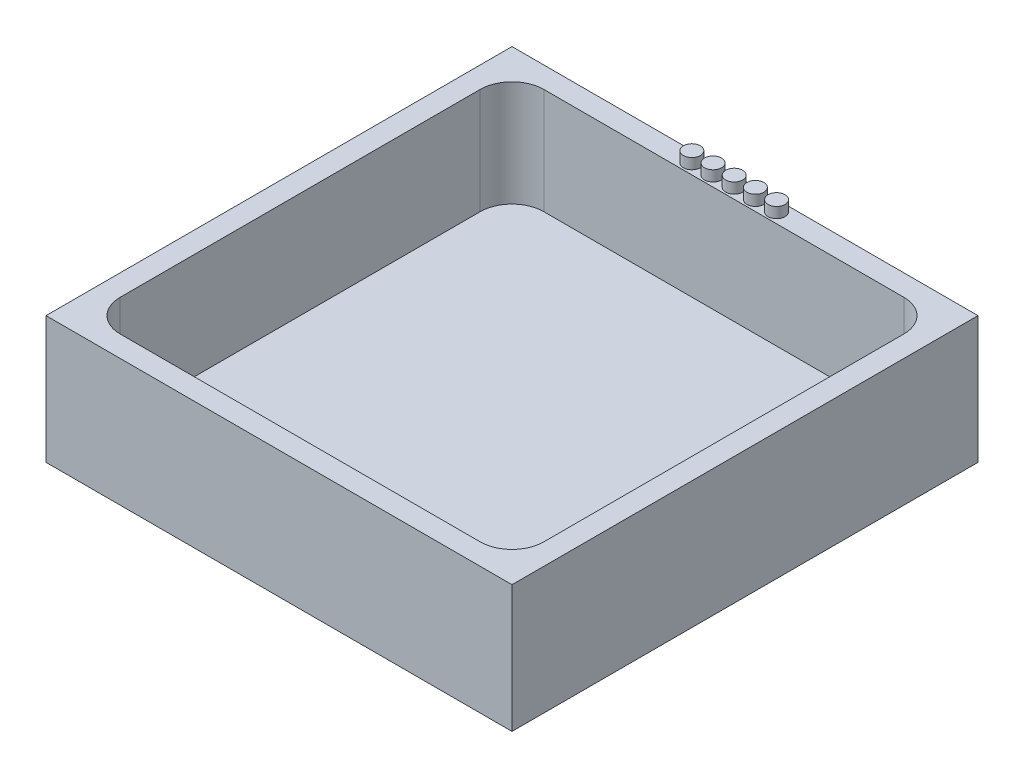
ISO-10303-21;
HEADER;
FILE_DESCRIPTION(('STEP AP214'),'2;1');
FILE_NAME('part.step','',(''),(''),'','','');
FILE_SCHEMA(('AUTOMOTIVE_DESIGN { 1 0 10303 214 1 1 1 1 }'));
ENDSEC;
DATA;
#1=APPLICATION_CONTEXT('core data for automotive mechanical design processes');
#2=APPLICATION_PROTOCOL_DEFINITION('international standard','automotive_design',2000,#1);
#3=PRODUCT_CONTEXT('',#1,'mechanical');
#4=PRODUCT('Part','Part','',(#3));
#5=PRODUCT_RELATED_PRODUCT_CATEGORY('part','',(#4));
#6=PRODUCT_DEFINITION_FORMATION('','',#4);
#7=PRODUCT_DEFINITION_CONTEXT('part definition',#1,'design');
#8=PRODUCT_DEFINITION('design','',#6,#7);
#9=PRODUCT_DEFINITION_SHAPE('','',#8);
#10=(LENGTH_UNIT() NAMED_UNIT(*) SI_UNIT(.MILLI.,.METRE.));
#11=(NAMED_UNIT(*) PLANE_ANGLE_UNIT() SI_UNIT($,.RADIAN.));
#12=(NAMED_UNIT(*) SI_UNIT($,.STERADIAN.) SOLID_ANGLE_UNIT());
#13=UNCERTAINTY_MEASURE_WITH_UNIT(LENGTH_MEASURE(1.E-05),#10,'distance_accuracy_value','');
#14=(GEOMETRIC_REPRESENTATION_CONTEXT(3) GLOBAL_UNCERTAINTY_ASSIGNED_CONTEXT((#13)) GLOBAL_UNIT_ASSIGNED_CONTEXT((#10,
#11,#12)) REPRESENTATION_CONTEXT('',''));
#15=CARTESIAN_POINT('',(0.,0.,0.));
#16=DIRECTION('',(0.,0.,1.));
#17=DIRECTION('',(1.,0.,0.));
#18=AXIS2_PLACEMENT_3D('',#15,#16,#17);
#19=CARTESIAN_POINT('',(0.,1.,0.));
#20=DIRECTION('',(0.,-1.,0.));
#21=DIRECTION('',(0.,0.,-1.));
#22=AXIS2_PLACEMENT_3D('',#19,#20,#21);
#23=PLANE('',#22);
#24=DIRECTION('',(1.,0.,0.));
#25=VECTOR('',#24,1.);
#26=CARTESIAN_POINT('',(-10.,1.,10.));
#27=LINE('',#26,#25);
#28=CARTESIAN_POINT('',(-8.5,1.,10.));
#29=VERTEX_POINT('',#28);
#30=CARTESIAN_POINT('',(8.5,1.,10.));
#31=VERTEX_POINT('',#30);
#32=EDGE_CURVE('E166',#29,#31,#27,.T.);
#33=ORIENTED_EDGE('',*,*,#32,.T.);
#34=CARTESIAN_POINT('',(8.5,1.,8.5));
#35=DIRECTION('',(0.,-1.,0.));
#36=DIRECTION('',(0.,0.,-1.));
#37=AXIS2_PLACEMENT_3D('',#34,#35,#36);
#38=CIRCLE('',#37,1.5);
#39=CARTESIAN_POINT('',(10.,1.,8.5));
#40=VERTEX_POINT('',#39);
#41=EDGE_CURVE('E195',#31,#40,#38,.F.);
#42=ORIENTED_EDGE('',*,*,#41,.T.);
#43=DIRECTION('',(0.,0.,-1.));
#44=VECTOR('',#43,1.);
#45=CARTESIAN_POINT('',(10.,1.,10.));
#46=LINE('',#45,#44);
#47=CARTESIAN_POINT('',(10.,1.,-8.5));
#48=VERTEX_POINT('',#47);
#49=EDGE_CURVE('E163',#40,#48,#46,.T.);
#50=ORIENTED_EDGE('',*,*,#49,.T.);
#51=CARTESIAN_POINT('',(8.5,1.,-8.5));
#52=DIRECTION('',(0.,-1.,0.));
#53=DIRECTION('',(0.,0.,-1.));
#54=AXIS2_PLACEMENT_3D('',#51,#52,#53);
#55=CIRCLE('',#54,1.5);
#56=CARTESIAN_POINT('',(8.5,1.,-10.));
#57=VERTEX_POINT('',#56);
#58=EDGE_CURVE('E189',#48,#57,#55,.F.);
#59=ORIENTED_EDGE('',*,*,#58,.T.);
#60=DIRECTION('',(1.,0.,0.));
#61=VECTOR('',#60,1.);
#62=CARTESIAN_POINT('',(-10.,1.,-10.));
#63=LINE('',#62,#61);
#64=CARTESIAN_POINT('',(-8.5,1.,-10.));
#65=VERTEX_POINT('',#64);
#66=EDGE_CURVE('E155',#65,#57,#63,.T.);
#67=ORIENTED_EDGE('',*,*,#66,.F.);
#68=CARTESIAN_POINT('',(-8.5,1.,-8.5));
#69=DIRECTION('',(0.,-1.,0.));
#70=DIRECTION('',(0.,0.,-1.));
#71=AXIS2_PLACEMENT_3D('',#68,#69,#70);
#72=CIRCLE('',#71,1.5);
#73=CARTESIAN_POINT('',(-10.,1.,-8.5));
#74=VERTEX_POINT('',#73);
#75=EDGE_CURVE('E193',#65,#74,#72,.F.);
#76=ORIENTED_EDGE('',*,*,#75,.T.);
#77=DIRECTION('',(0.,0.,-1.));
#78=VECTOR('',#77,1.);
#79=CARTESIAN_POINT('',(-10.,1.,10.));
#80=LINE('',#79,#78);
#81=CARTESIAN_POINT('',(-10.,1.,8.5));
#82=VERTEX_POINT('',#81);
#83=EDGE_CURVE('E153',#82,#74,#80,.T.);
#84=ORIENTED_EDGE('',*,*,#83,.F.);
#85=CARTESIAN_POINT('',(-8.5,1.,8.5));
#86=DIRECTION('',(0.,-1.,0.));
#87=DIRECTION('',(0.,0.,-1.));
#88=AXIS2_PLACEMENT_3D('',#85,#86,#87);
#89=CIRCLE('',#88,1.5);
#90=EDGE_CURVE('E191',#82,#29,#89,.F.);
#91=ORIENTED_EDGE('',*,*,#90,.T.);
#92=EDGE_LOOP('',(#33,#42,#50,#59,#67,#76,#84,#91));
#93=FACE_BOUND('',#92,.T.);
#94=ADVANCED_FACE('F39',(#93),#23,.F.);
#95=CARTESIAN_POINT('',(10.,6.,10.));
#96=DIRECTION('',(-1.,0.,0.));
#97=DIRECTION('',(0.,0.,1.));
#98=AXIS2_PLACEMENT_3D('',#95,#96,#97);
#99=PLANE('',#98);
#100=ORIENTED_EDGE('',*,*,#49,.F.);
#101=DIRECTION('',(0.,-1.,0.));
#102=VECTOR('',#101,1.);
#103=CARTESIAN_POINT('',(10.,6.,8.5));
#104=LINE('',#103,#102);
#105=CARTESIAN_POINT('',(10.,6.,8.5));
#106=VERTEX_POINT('',#105);
#107=EDGE_CURVE('E200',#40,#106,#104,.F.);
#108=ORIENTED_EDGE('',*,*,#107,.T.);
#109=DIRECTION('',(0.,0.,-1.));
#110=VECTOR('',#109,1.);
#111=CARTESIAN_POINT('',(10.,6.,10.));
#112=LINE('',#111,#110);
#113=CARTESIAN_POINT('',(10.,6.,-8.5));
#114=VERTEX_POINT('',#113);
#115=EDGE_CURVE('E227',#106,#114,#112,.T.);
#116=ORIENTED_EDGE('',*,*,#115,.T.);
#117=DIRECTION('',(0.,-1.,0.));
#118=VECTOR('',#117,1.);
#119=CARTESIAN_POINT('',(10.,1.,-8.5));
#120=LINE('',#119,#118);
#121=EDGE_CURVE('E197',#114,#48,#120,.T.);
#122=ORIENTED_EDGE('',*,*,#121,.T.);
#123=EDGE_LOOP('',(#100,#108,#116,#122));
#124=FACE_BOUND('',#123,.T.);
#125=ADVANCED_FACE('F249',(#124),#99,.T.);
#126=CARTESIAN_POINT('',(-10.,6.,-10.));
#127=DIRECTION('',(0.,0.,1.));
#128=DIRECTION('',(1.,0.,0.));
#129=AXIS2_PLACEMENT_3D('',#126,#127,#128);
#130=PLANE('',#129);
#131=DIRECTION('',(-1.,0.,0.));
#132=VECTOR('',#131,1.);
#133=CARTESIAN_POINT('',(-10.,6.,-10.));
#134=LINE('',#133,#132);
#135=CARTESIAN_POINT('',(8.5,6.,-10.));
#136=VERTEX_POINT('',#135);
#137=CARTESIAN_POINT('',(-8.5,6.,-10.));
#138=VERTEX_POINT('',#137);
#139=EDGE_CURVE('E218',#136,#138,#134,.T.);
#140=ORIENTED_EDGE('',*,*,#139,.T.);
#141=DIRECTION('',(0.,-1.,0.));
#142=VECTOR('',#141,1.);
#143=CARTESIAN_POINT('',(-8.5,1.,-10.));
#144=LINE('',#143,#142);
#145=EDGE_CURVE('E204',#138,#65,#144,.T.);
#146=ORIENTED_EDGE('',*,*,#145,.T.);
#147=ORIENTED_EDGE('',*,*,#66,.T.);
#148=DIRECTION('',(0.,-1.,0.));
#149=VECTOR('',#148,1.);
#150=CARTESIAN_POINT('',(8.5,6.,-10.));
#151=LINE('',#150,#149);
#152=EDGE_CURVE('E202',#57,#136,#151,.F.);
#153=ORIENTED_EDGE('',*,*,#152,.T.);
#154=EDGE_LOOP('',(#140,#146,#147,#153));
#155=FACE_BOUND('',#154,.T.);
#156=ADVANCED_FACE('F224',(#155),#130,.T.);
#157=CARTESIAN_POINT('',(-10.,6.,10.));
#158=DIRECTION('',(1.,0.,0.));
#159=DIRECTION('',(0.,0.,-1.));
#160=AXIS2_PLACEMENT_3D('',#157,#158,#159);
#161=PLANE('',#160);
#162=ORIENTED_EDGE('',*,*,#83,.T.);
#163=DIRECTION('',(0.,-1.,0.));
#164=VECTOR('',#163,1.);
#165=CARTESIAN_POINT('',(-10.,6.,-8.5));
#166=LINE('',#165,#164);
#167=CARTESIAN_POINT('',(-10.,6.,-8.5));
#168=VERTEX_POINT('',#167);
#169=EDGE_CURVE('E60',#74,#168,#166,.F.);
#170=ORIENTED_EDGE('',*,*,#169,.T.);
#171=DIRECTION('',(0.,0.,1.));
#172=VECTOR('',#171,1.);
#173=CARTESIAN_POINT('',(-10.,6.,10.));
#174=LINE('',#173,#172);
#175=CARTESIAN_POINT('',(-10.,6.,8.5));
#176=VERTEX_POINT('',#175);
#177=EDGE_CURVE('E220',#168,#176,#174,.T.);
#178=ORIENTED_EDGE('',*,*,#177,.T.);
#179=DIRECTION('',(0.,-1.,0.));
#180=VECTOR('',#179,1.);
#181=CARTESIAN_POINT('',(-10.,1.,8.5));
#182=LINE('',#181,#180);
#183=EDGE_CURVE('E207',#176,#82,#182,.T.);
#184=ORIENTED_EDGE('',*,*,#183,.T.);
#185=EDGE_LOOP('',(#162,#170,#178,#184));
#186=FACE_BOUND('',#185,.T.);
#187=ADVANCED_FACE('F232',(#186),#161,.T.);
#188=CARTESIAN_POINT('',(-10.,6.,10.));
#189=DIRECTION('',(0.,0.,-1.));
#190=DIRECTION('',(-1.,0.,0.));
#191=AXIS2_PLACEMENT_3D('',#188,#189,#190);
#192=PLANE('',#191);
#193=DIRECTION('',(1.,0.,0.));
#194=VECTOR('',#193,1.);
#195=CARTESIAN_POINT('',(-10.,6.,10.));
#196=LINE('',#195,#194);
#197=CARTESIAN_POINT('',(-8.5,6.,10.));
#198=VERTEX_POINT('',#197);
#199=CARTESIAN_POINT('',(8.5,6.,10.));
#200=VERTEX_POINT('',#199);
#201=EDGE_CURVE('E242',#198,#200,#196,.T.);
#202=ORIENTED_EDGE('',*,*,#201,.T.);
#203=DIRECTION('',(0.,-1.,0.));
#204=VECTOR('',#203,1.);
#205=CARTESIAN_POINT('',(8.5,1.,10.));
#206=LINE('',#205,#204);
#207=EDGE_CURVE('E186',#200,#31,#206,.T.);
#208=ORIENTED_EDGE('',*,*,#207,.T.);
#209=ORIENTED_EDGE('',*,*,#32,.F.);
#210=DIRECTION('',(0.,-1.,0.));
#211=VECTOR('',#210,1.);
#212=CARTESIAN_POINT('',(-8.5,6.,10.));
#213=LINE('',#212,#211);
#214=EDGE_CURVE('E184',#29,#198,#213,.F.);
#215=ORIENTED_EDGE('',*,*,#214,.T.);
#216=EDGE_LOOP('',(#202,#208,#209,#215));
#217=FACE_BOUND('',#216,.T.);
#218=ADVANCED_FACE('F240',(#217),#192,.T.);
#219=CARTESIAN_POINT('',(0.,6.,0.));
#220=DIRECTION('',(0.,-1.,0.));
#221=DIRECTION('',(0.,0.,-1.));
#222=AXIS2_PLACEMENT_3D('',#219,#220,#221);
#223=PLANE('',#222);
#224=CARTESIAN_POINT('',(2.,6.,-10.4901556882709));
#225=DIRECTION('',(0.,-1.,0.));
#226=DIRECTION('',(0.,0.,-1.));
#227=AXIS2_PLACEMENT_3D('',#224,#225,#226);
#228=CIRCLE('',#227,0.4);
#229=CARTESIAN_POINT('',(2.,6.,-10.8901556882709));
#230=VERTEX_POINT('',#229);
#231=EDGE_CURVE('E181',#230,#230,#228,.F.);
#232=ORIENTED_EDGE('',*,*,#231,.F.);
#233=EDGE_LOOP('',(#232));
#234=FACE_BOUND('',#233,.T.);
#235=CARTESIAN_POINT('',(-2.,6.,-10.4901556882709));
#236=DIRECTION('',(0.,-1.,0.));
#237=DIRECTION('',(0.,0.,-1.));
#238=AXIS2_PLACEMENT_3D('',#235,#236,#237);
#239=CIRCLE('',#238,0.4);
#240=CARTESIAN_POINT('',(-2.,6.,-10.8901556882709));
#241=VERTEX_POINT('',#240);
#242=EDGE_CURVE('E178',#241,#241,#239,.F.);
#243=ORIENTED_EDGE('',*,*,#242,.F.);
#244=EDGE_LOOP('',(#243));
#245=FACE_BOUND('',#244,.T.);
#246=CARTESIAN_POINT('',(-1.,6.,-10.4901556882709));
#247=DIRECTION('',(0.,-1.,0.));
#248=DIRECTION('',(0.,0.,-1.));
#249=AXIS2_PLACEMENT_3D('',#246,#247,#248);
#250=CIRCLE('',#249,0.4);
#251=CARTESIAN_POINT('',(-1.,6.,-10.8901556882709));
#252=VERTEX_POINT('',#251);
#253=EDGE_CURVE('E175',#252,#252,#250,.F.);
#254=ORIENTED_EDGE('',*,*,#253,.F.);
#255=EDGE_LOOP('',(#254));
#256=FACE_BOUND('',#255,.T.);
#257=CARTESIAN_POINT('',(1.,6.,-10.4901556882709));
#258=DIRECTION('',(0.,-1.,0.));
#259=DIRECTION('',(0.,0.,-1.));
#260=AXIS2_PLACEMENT_3D('',#257,#258,#259);
#261=CIRCLE('',#260,0.4);
#262=CARTESIAN_POINT('',(1.,6.,-10.8901556882709));
#263=VERTEX_POINT('',#262);
#264=EDGE_CURVE('E172',#263,#263,#261,.F.);
#265=ORIENTED_EDGE('',*,*,#264,.F.);
#266=EDGE_LOOP('',(#265));
#267=FACE_BOUND('',#266,.T.);
#268=CARTESIAN_POINT('',(0.,6.,-10.4901556882709));
#269=DIRECTION('',(0.,-1.,0.));
#270=DIRECTION('',(0.,0.,-1.));
#271=AXIS2_PLACEMENT_3D('',#268,#269,#270);
#272=CIRCLE('',#271,0.4);
#273=CARTESIAN_POINT('',(0.,6.,-10.8901556882709));
#274=VERTEX_POINT('',#273);
#275=EDGE_CURVE('E169',#274,#274,#272,.F.);
#276=ORIENTED_EDGE('',*,*,#275,.F.);
#277=EDGE_LOOP('',(#276));
#278=FACE_BOUND('',#277,.T.);
#279=DIRECTION('',(0.,0.,-1.));
#280=VECTOR('',#279,1.);
#281=CARTESIAN_POINT('',(11.,6.,11.));
#282=LINE('',#281,#280);
#283=CARTESIAN_POINT('',(11.,6.,11.));
#284=VERTEX_POINT('',#283);
#285=CARTESIAN_POINT('',(11.,6.,-11.));
#286=VERTEX_POINT('',#285);
#287=EDGE_CURVE('E139',#284,#286,#282,.T.);
#288=ORIENTED_EDGE('',*,*,#287,.T.);
#289=DIRECTION('',(-1.,0.,0.));
#290=VECTOR('',#289,1.);
#291=CARTESIAN_POINT('',(-11.,6.,-11.));
#292=LINE('',#291,#290);
#293=CARTESIAN_POINT('',(-11.,6.,-11.));
#294=VERTEX_POINT('',#293);
#295=EDGE_CURVE('E128',#286,#294,#292,.T.);
#296=ORIENTED_EDGE('',*,*,#295,.T.);
#297=DIRECTION('',(0.,0.,1.));
#298=VECTOR('',#297,1.);
#299=CARTESIAN_POINT('',(-11.,6.,11.));
#300=LINE('',#299,#298);
#301=CARTESIAN_POINT('',(-11.,6.,11.));
#302=VERTEX_POINT('',#301);
#303=EDGE_CURVE('E138',#294,#302,#300,.T.);
#304=ORIENTED_EDGE('',*,*,#303,.T.);
#305=DIRECTION('',(1.,0.,0.));
#306=VECTOR('',#305,1.);
#307=CARTESIAN_POINT('',(-11.,6.,11.));
#308=LINE('',#307,#306);
#309=EDGE_CURVE('E144',#302,#284,#308,.T.);
#310=ORIENTED_EDGE('',*,*,#309,.T.);
#311=EDGE_LOOP('',(#288,#296,#304,#310));
#312=FACE_BOUND('',#311,.T.);
#313=ORIENTED_EDGE('',*,*,#115,.F.);
#314=CARTESIAN_POINT('',(8.5,6.,8.5));
#315=DIRECTION('',(0.,-1.,0.));
#316=DIRECTION('',(0.,0.,-1.));
#317=AXIS2_PLACEMENT_3D('',#314,#315,#316);
#318=CIRCLE('',#317,1.5);
#319=EDGE_CURVE('E211',#106,#200,#318,.T.);
#320=ORIENTED_EDGE('',*,*,#319,.T.);
#321=ORIENTED_EDGE('',*,*,#201,.F.);
#322=CARTESIAN_POINT('',(-8.5,6.,8.5));
#323=DIRECTION('',(0.,-1.,0.));
#324=DIRECTION('',(0.,0.,-1.));
#325=AXIS2_PLACEMENT_3D('',#322,#323,#324);
#326=CIRCLE('',#325,1.5);
#327=EDGE_CURVE('E47',#198,#176,#326,.T.);
#328=ORIENTED_EDGE('',*,*,#327,.T.);
#329=ORIENTED_EDGE('',*,*,#177,.F.);
#330=CARTESIAN_POINT('',(-8.5,6.,-8.5));
#331=DIRECTION('',(0.,-1.,0.));
#332=DIRECTION('',(0.,0.,-1.));
#333=AXIS2_PLACEMENT_3D('',#330,#331,#332);
#334=CIRCLE('',#333,1.5);
#335=EDGE_CURVE('E213',#168,#138,#334,.T.);
#336=ORIENTED_EDGE('',*,*,#335,.T.);
#337=ORIENTED_EDGE('',*,*,#139,.F.);
#338=CARTESIAN_POINT('',(8.5,6.,-8.5));
#339=DIRECTION('',(0.,-1.,0.));
#340=DIRECTION('',(0.,0.,-1.));
#341=AXIS2_PLACEMENT_3D('',#338,#339,#340);
#342=CIRCLE('',#341,1.5);
#343=EDGE_CURVE('E11',#136,#114,#342,.T.);
#344=ORIENTED_EDGE('',*,*,#343,.T.);
#345=EDGE_LOOP('',(#313,#320,#321,#328,#329,#336,#337,#344));
#346=FACE_BOUND('',#345,.T.);
#347=ADVANCED_FACE('F142',(#234,#245,#256,#267,#278,#312,#346),#223,.F.);
#348=CARTESIAN_POINT('',(11.,6.,11.));
#349=DIRECTION('',(-1.,0.,0.));
#350=DIRECTION('',(0.,0.,1.));
#351=AXIS2_PLACEMENT_3D('',#348,#349,#350);
#352=PLANE('',#351);
#353=DIRECTION('',(0.,0.,-1.));
#354=VECTOR('',#353,1.);
#355=CARTESIAN_POINT('',(11.,0.,11.));
#356=LINE('',#355,#354);
#357=CARTESIAN_POINT('',(11.,0.,11.));
#358=VERTEX_POINT('',#357);
#359=CARTESIAN_POINT('',(11.,0.,-11.));
#360=VERTEX_POINT('',#359);
#361=EDGE_CURVE('E152',#358,#360,#356,.T.);
#362=ORIENTED_EDGE('',*,*,#361,.T.);
#363=DIRECTION('',(0.,-1.,0.));
#364=VECTOR('',#363,1.);
#365=CARTESIAN_POINT('',(11.,6.,-11.));
#366=LINE('',#365,#364);
#367=EDGE_CURVE('E132',#286,#360,#366,.T.);
#368=ORIENTED_EDGE('',*,*,#367,.F.);
#369=ORIENTED_EDGE('',*,*,#287,.F.);
#370=DIRECTION('',(0.,-1.,0.));
#371=VECTOR('',#370,1.);
#372=CARTESIAN_POINT('',(11.,6.,11.));
#373=LINE('',#372,#371);
#374=EDGE_CURVE('E264',#284,#358,#373,.T.);
#375=ORIENTED_EDGE('',*,*,#374,.T.);
#376=EDGE_LOOP('',(#362,#368,#369,#375));
#377=FACE_BOUND('',#376,.T.);
#378=ADVANCED_FACE('F150',(#377),#352,.F.);
#379=CARTESIAN_POINT('',(-11.,6.,-11.));
#380=DIRECTION('',(0.,0.,1.));
#381=DIRECTION('',(1.,0.,0.));
#382=AXIS2_PLACEMENT_3D('',#379,#380,#381);
#383=PLANE('',#382);
#384=DIRECTION('',(-1.,0.,0.));
#385=VECTOR('',#384,1.);
#386=CARTESIAN_POINT('',(-11.,0.,-11.));
#387=LINE('',#386,#385);
#388=CARTESIAN_POINT('',(-11.,0.,-11.));
#389=VERTEX_POINT('',#388);
#390=EDGE_CURVE('E266',#360,#389,#387,.T.);
#391=ORIENTED_EDGE('',*,*,#390,.T.);
#392=DIRECTION('',(0.,-1.,0.));
#393=VECTOR('',#392,1.);
#394=CARTESIAN_POINT('',(-11.,6.,-11.));
#395=LINE('',#394,#393);
#396=EDGE_CURVE('E135',#294,#389,#395,.T.);
#397=ORIENTED_EDGE('',*,*,#396,.F.);
#398=ORIENTED_EDGE('',*,*,#295,.F.);
#399=ORIENTED_EDGE('',*,*,#367,.T.);
#400=EDGE_LOOP('',(#391,#397,#398,#399));
#401=FACE_BOUND('',#400,.T.);
#402=ADVANCED_FACE('F130',(#401),#383,.F.);
#403=CARTESIAN_POINT('',(-11.,6.,11.));
#404=DIRECTION('',(1.,0.,0.));
#405=DIRECTION('',(0.,0.,-1.));
#406=AXIS2_PLACEMENT_3D('',#403,#404,#405);
#407=PLANE('',#406);
#408=DIRECTION('',(0.,0.,1.));
#409=VECTOR('',#408,1.);
#410=CARTESIAN_POINT('',(-11.,0.,11.));
#411=LINE('',#410,#409);
#412=CARTESIAN_POINT('',(-11.,0.,11.));
#413=VERTEX_POINT('',#412);
#414=EDGE_CURVE('E268',#389,#413,#411,.T.);
#415=ORIENTED_EDGE('',*,*,#414,.T.);
#416=DIRECTION('',(0.,-1.,0.));
#417=VECTOR('',#416,1.);
#418=CARTESIAN_POINT('',(-11.,6.,11.));
#419=LINE('',#418,#417);
#420=EDGE_CURVE('E157',#302,#413,#419,.T.);
#421=ORIENTED_EDGE('',*,*,#420,.F.);
#422=ORIENTED_EDGE('',*,*,#303,.F.);
#423=ORIENTED_EDGE('',*,*,#396,.T.);
#424=EDGE_LOOP('',(#415,#421,#422,#423));
#425=FACE_BOUND('',#424,.T.);
#426=ADVANCED_FACE('F280',(#425),#407,.F.);
#427=CARTESIAN_POINT('',(-11.,6.,11.));
#428=DIRECTION('',(0.,0.,-1.));
#429=DIRECTION('',(-1.,0.,0.));
#430=AXIS2_PLACEMENT_3D('',#427,#428,#429);
#431=PLANE('',#430);
#432=DIRECTION('',(1.,0.,0.));
#433=VECTOR('',#432,1.);
#434=CARTESIAN_POINT('',(-11.,0.,11.));
#435=LINE('',#434,#433);
#436=EDGE_CURVE('E148',#413,#358,#435,.T.);
#437=ORIENTED_EDGE('',*,*,#436,.T.);
#438=ORIENTED_EDGE('',*,*,#374,.F.);
#439=ORIENTED_EDGE('',*,*,#309,.F.);
#440=ORIENTED_EDGE('',*,*,#420,.T.);
#441=EDGE_LOOP('',(#437,#438,#439,#440));
#442=FACE_BOUND('',#441,.T.);
#443=ADVANCED_FACE('F275',(#442),#431,.F.);
#444=CARTESIAN_POINT('',(0.,0.,0.));
#445=DIRECTION('',(0.,-1.,0.));
#446=DIRECTION('',(0.,0.,-1.));
#447=AXIS2_PLACEMENT_3D('',#444,#445,#446);
#448=PLANE('',#447);
#449=ORIENTED_EDGE('',*,*,#361,.F.);
#450=ORIENTED_EDGE('',*,*,#436,.F.);
#451=ORIENTED_EDGE('',*,*,#414,.F.);
#452=ORIENTED_EDGE('',*,*,#390,.F.);
#453=EDGE_LOOP('',(#449,#450,#451,#452));
#454=FACE_BOUND('',#453,.T.);
#455=ADVANCED_FACE('F279',(#454),#448,.T.);
#456=CARTESIAN_POINT('',(0.,6.5,-10.4901556882709));
#457=DIRECTION('',(0.,-1.,0.));
#458=DIRECTION('',(0.,0.,-1.));
#459=AXIS2_PLACEMENT_3D('',#456,#457,#458);
#460=CYLINDRICAL_SURFACE('',#459,0.4);
#461=CARTESIAN_POINT('',(0.,6.5,-10.4901556882709));
#462=DIRECTION('',(0.,1.,0.));
#463=DIRECTION('',(0.,0.,1.));
#464=AXIS2_PLACEMENT_3D('',#461,#462,#463);
#465=CIRCLE('',#464,0.4);
#466=CARTESIAN_POINT('',(0.,6.5,-10.0901556882709));
#467=VERTEX_POINT('',#466);
#468=EDGE_CURVE('E253',#467,#467,#465,.T.);
#469=ORIENTED_EDGE('',*,*,#468,.F.);
#470=EDGE_LOOP('',(#469));
#471=FACE_BOUND('',#470,.T.);
#472=ORIENTED_EDGE('',*,*,#275,.T.);
#473=EDGE_LOOP('',(#472));
#474=FACE_BOUND('',#473,.T.);
#475=ADVANCED_FACE('F300',(#471,#474),#460,.T.);
#476=CARTESIAN_POINT('',(0.,6.5,-10.4901556882709));
#477=DIRECTION('',(0.,1.,0.));
#478=DIRECTION('',(0.,0.,1.));
#479=AXIS2_PLACEMENT_3D('',#476,#477,#478);
#480=PLANE('',#479);
#481=ORIENTED_EDGE('',*,*,#468,.T.);
#482=EDGE_LOOP('',(#481));
#483=FACE_BOUND('',#482,.T.);
#484=ADVANCED_FACE('F407',(#483),#480,.T.);
#485=CARTESIAN_POINT('',(1.,6.5,-10.4901556882709));
#486=DIRECTION('',(0.,-1.,0.));
#487=DIRECTION('',(0.,0.,-1.));
#488=AXIS2_PLACEMENT_3D('',#485,#486,#487);
#489=CYLINDRICAL_SURFACE('',#488,0.4);
#490=CARTESIAN_POINT('',(1.,6.5,-10.4901556882709));
#491=DIRECTION('',(0.,1.,0.));
#492=DIRECTION('',(0.,0.,1.));
#493=AXIS2_PLACEMENT_3D('',#490,#491,#492);
#494=CIRCLE('',#493,0.4);
#495=CARTESIAN_POINT('',(1.,6.5,-10.0901556882709));
#496=VERTEX_POINT('',#495);
#497=EDGE_CURVE('E256',#496,#496,#494,.T.);
#498=ORIENTED_EDGE('',*,*,#497,.F.);
#499=EDGE_LOOP('',(#498));
#500=FACE_BOUND('',#499,.T.);
#501=ORIENTED_EDGE('',*,*,#264,.T.);
#502=EDGE_LOOP('',(#501));
#503=FACE_BOUND('',#502,.T.);
#504=ADVANCED_FACE('F397',(#500,#503),#489,.T.);
#505=CARTESIAN_POINT('',(1.,6.5,-10.4901556882709));
#506=DIRECTION('',(0.,1.,0.));
#507=DIRECTION('',(0.,0.,1.));
#508=AXIS2_PLACEMENT_3D('',#505,#506,#507);
#509=PLANE('',#508);
#510=ORIENTED_EDGE('',*,*,#497,.T.);
#511=EDGE_LOOP('',(#510));
#512=FACE_BOUND('',#511,.T.);
#513=ADVANCED_FACE('F387',(#512),#509,.T.);
#514=CARTESIAN_POINT('',(-1.,6.5,-10.4901556882709));
#515=DIRECTION('',(0.,-1.,0.));
#516=DIRECTION('',(0.,0.,-1.));
#517=AXIS2_PLACEMENT_3D('',#514,#515,#516);
#518=CYLINDRICAL_SURFACE('',#517,0.4);
#519=CARTESIAN_POINT('',(-1.,6.5,-10.4901556882709));
#520=DIRECTION('',(0.,1.,0.));
#521=DIRECTION('',(0.,0.,1.));
#522=AXIS2_PLACEMENT_3D('',#519,#520,#521);
#523=CIRCLE('',#522,0.4);
#524=CARTESIAN_POINT('',(-1.,6.5,-10.0901556882709));
#525=VERTEX_POINT('',#524);
#526=EDGE_CURVE('E520',#525,#525,#523,.T.);
#527=ORIENTED_EDGE('',*,*,#526,.F.);
#528=EDGE_LOOP('',(#527));
#529=FACE_BOUND('',#528,.T.);
#530=ORIENTED_EDGE('',*,*,#253,.T.);
#531=EDGE_LOOP('',(#530));
#532=FACE_BOUND('',#531,.T.);
#533=ADVANCED_FACE('F377',(#529,#532),#518,.T.);
#534=CARTESIAN_POINT('',(-1.,6.5,-10.4901556882709));
#535=DIRECTION('',(0.,1.,0.));
#536=DIRECTION('',(0.,0.,1.));
#537=AXIS2_PLACEMENT_3D('',#534,#535,#536);
#538=PLANE('',#537);
#539=ORIENTED_EDGE('',*,*,#526,.T.);
#540=EDGE_LOOP('',(#539));
#541=FACE_BOUND('',#540,.T.);
#542=ADVANCED_FACE('F367',(#541),#538,.T.);
#543=CARTESIAN_POINT('',(-2.,6.5,-10.4901556882709));
#544=DIRECTION('',(0.,-1.,0.));
#545=DIRECTION('',(0.,0.,-1.));
#546=AXIS2_PLACEMENT_3D('',#543,#544,#545);
#547=CYLINDRICAL_SURFACE('',#546,0.4);
#548=CARTESIAN_POINT('',(-2.,6.5,-10.4901556882709));
#549=DIRECTION('',(0.,1.,0.));
#550=DIRECTION('',(0.,0.,1.));
#551=AXIS2_PLACEMENT_3D('',#548,#549,#550);
#552=CIRCLE('',#551,0.4);
#553=CARTESIAN_POINT('',(-2.,6.5,-10.0901556882709));
#554=VERTEX_POINT('',#553);
#555=EDGE_CURVE('E522',#554,#554,#552,.T.);
#556=ORIENTED_EDGE('',*,*,#555,.F.);
#557=EDGE_LOOP('',(#556));
#558=FACE_BOUND('',#557,.T.);
#559=ORIENTED_EDGE('',*,*,#242,.T.);
#560=EDGE_LOOP('',(#559));
#561=FACE_BOUND('',#560,.T.);
#562=ADVANCED_FACE('F357',(#558,#561),#547,.T.);
#563=CARTESIAN_POINT('',(-2.,6.5,-10.4901556882709));
#564=DIRECTION('',(0.,1.,0.));
#565=DIRECTION('',(0.,0.,1.));
#566=AXIS2_PLACEMENT_3D('',#563,#564,#565);
#567=PLANE('',#566);
#568=ORIENTED_EDGE('',*,*,#555,.T.);
#569=EDGE_LOOP('',(#568));
#570=FACE_BOUND('',#569,.T.);
#571=ADVANCED_FACE('F347',(#570),#567,.T.);
#572=CARTESIAN_POINT('',(2.,6.5,-10.4901556882709));
#573=DIRECTION('',(0.,-1.,0.));
#574=DIRECTION('',(0.,0.,-1.));
#575=AXIS2_PLACEMENT_3D('',#572,#573,#574);
#576=CYLINDRICAL_SURFACE('',#575,0.4);
#577=CARTESIAN_POINT('',(2.,6.5,-10.4901556882709));
#578=DIRECTION('',(0.,1.,0.));
#579=DIRECTION('',(0.,0.,1.));
#580=AXIS2_PLACEMENT_3D('',#577,#578,#579);
#581=CIRCLE('',#580,0.4);
#582=CARTESIAN_POINT('',(2.,6.5,-10.0901556882709));
#583=VERTEX_POINT('',#582);
#584=EDGE_CURVE('E527',#583,#583,#581,.T.);
#585=ORIENTED_EDGE('',*,*,#584,.F.);
#586=EDGE_LOOP('',(#585));
#587=FACE_BOUND('',#586,.T.);
#588=ORIENTED_EDGE('',*,*,#231,.T.);
#589=EDGE_LOOP('',(#588));
#590=FACE_BOUND('',#589,.T.);
#591=ADVANCED_FACE('F337',(#587,#590),#576,.T.);
#592=CARTESIAN_POINT('',(2.,6.5,-10.4901556882709));
#593=DIRECTION('',(0.,1.,0.));
#594=DIRECTION('',(0.,0.,1.));
#595=AXIS2_PLACEMENT_3D('',#592,#593,#594);
#596=PLANE('',#595);
#597=ORIENTED_EDGE('',*,*,#584,.T.);
#598=EDGE_LOOP('',(#597));
#599=FACE_BOUND('',#598,.T.);
#600=ADVANCED_FACE('F303',(#599),#596,.T.);
#601=CARTESIAN_POINT('',(8.5,6.,8.5));
#602=DIRECTION('',(0.,1.,0.));
#603=DIRECTION('',(0.,0.,1.));
#604=AXIS2_PLACEMENT_3D('',#601,#602,#603);
#605=CYLINDRICAL_SURFACE('',#604,1.5);
#606=ORIENTED_EDGE('',*,*,#319,.F.);
#607=ORIENTED_EDGE('',*,*,#107,.F.);
#608=ORIENTED_EDGE('',*,*,#41,.F.);
#609=ORIENTED_EDGE('',*,*,#207,.F.);
#610=EDGE_LOOP('',(#606,#607,#608,#609));
#611=FACE_BOUND('',#610,.T.);
#612=ADVANCED_FACE('F245',(#611),#605,.F.);
#613=CARTESIAN_POINT('',(-8.5,6.,-8.5));
#614=DIRECTION('',(0.,1.,0.));
#615=DIRECTION('',(0.,0.,1.));
#616=AXIS2_PLACEMENT_3D('',#613,#614,#615);
#617=CYLINDRICAL_SURFACE('',#616,1.5);
#618=ORIENTED_EDGE('',*,*,#335,.F.);
#619=ORIENTED_EDGE('',*,*,#169,.F.);
#620=ORIENTED_EDGE('',*,*,#75,.F.);
#621=ORIENTED_EDGE('',*,*,#145,.F.);
#622=EDGE_LOOP('',(#618,#619,#620,#621));
#623=FACE_BOUND('',#622,.T.);
#624=ADVANCED_FACE('F229',(#623),#617,.F.);
#625=CARTESIAN_POINT('',(-8.5,6.,8.5));
#626=DIRECTION('',(0.,1.,0.));
#627=DIRECTION('',(0.,0.,1.));
#628=AXIS2_PLACEMENT_3D('',#625,#626,#627);
#629=CYLINDRICAL_SURFACE('',#628,1.5);
#630=ORIENTED_EDGE('',*,*,#327,.F.);
#631=ORIENTED_EDGE('',*,*,#214,.F.);
#632=ORIENTED_EDGE('',*,*,#90,.F.);
#633=ORIENTED_EDGE('',*,*,#183,.F.);
#634=EDGE_LOOP('',(#630,#631,#632,#633));
#635=FACE_BOUND('',#634,.T.);
#636=ADVANCED_FACE('F235',(#635),#629,.F.);
#637=CARTESIAN_POINT('',(8.5,6.,-8.5));
#638=DIRECTION('',(0.,1.,0.));
#639=DIRECTION('',(0.,0.,1.));
#640=AXIS2_PLACEMENT_3D('',#637,#638,#639);
#641=CYLINDRICAL_SURFACE('',#640,1.5);
#642=ORIENTED_EDGE('',*,*,#343,.F.);
#643=ORIENTED_EDGE('',*,*,#152,.F.);
#644=ORIENTED_EDGE('',*,*,#58,.F.);
#645=ORIENTED_EDGE('',*,*,#121,.F.);
#646=EDGE_LOOP('',(#642,#643,#644,#645));
#647=FACE_BOUND('',#646,.T.);
#648=ADVANCED_FACE('F41',(#647),#641,.F.);
#649=CLOSED_SHELL('',(#94,#125,#156,#187,#218,#347,#378,#402,#426,#443,#455,#475,#484,#504,#513,
#533,#542,#562,#571,#591,#600,#612,#624,#636,#648));
#650=MANIFOLD_SOLID_BREP('B2',#649);
#651=ADVANCED_BREP_SHAPE_REPRESENTATION('',(#18,#650),#14);
#652=SHAPE_DEFINITION_REPRESENTATION(#9,#651);
ENDSEC;
END-ISO-10303-21;
